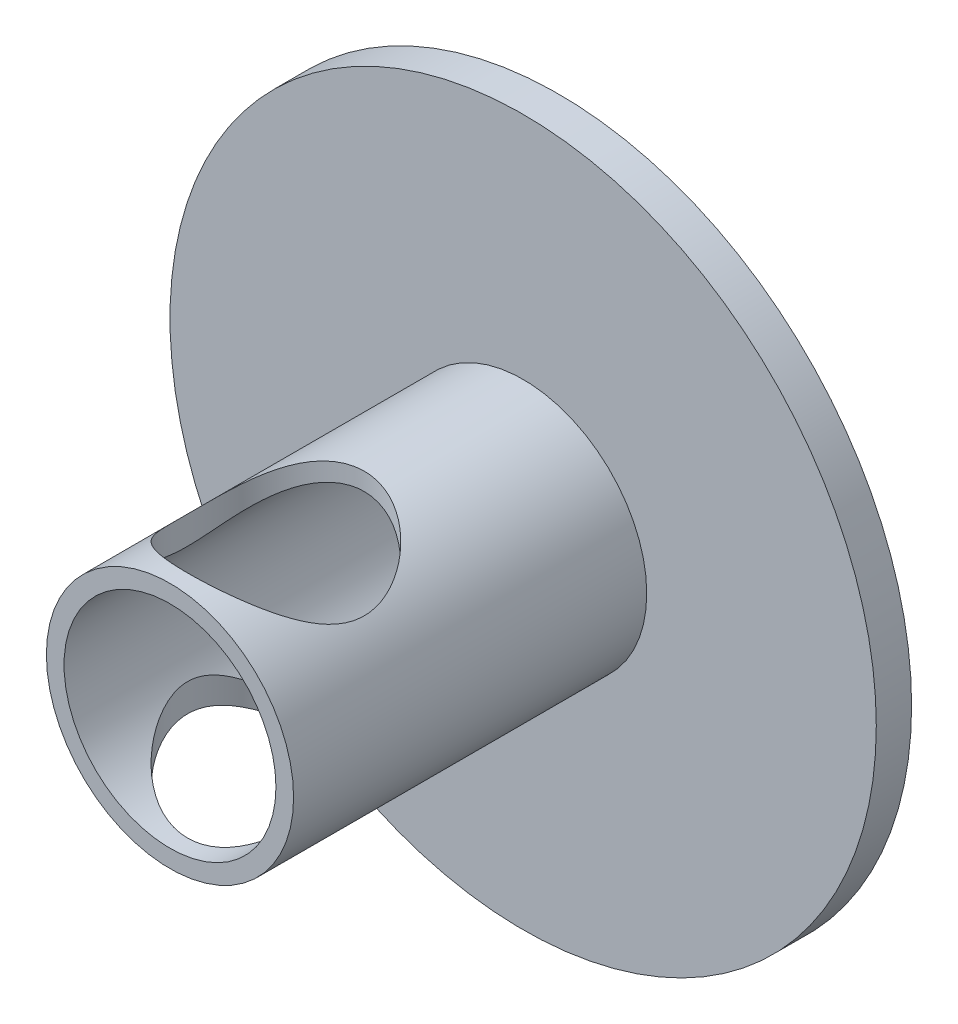
ISO-10303-21;
HEADER;
FILE_DESCRIPTION(('STEP AP214'),'2;1');
FILE_NAME('part.step','',(''),(''),'','','');
FILE_SCHEMA(('AUTOMOTIVE_DESIGN { 1 0 10303 214 1 1 1 1 }'));
ENDSEC;
DATA;
#1=APPLICATION_CONTEXT('core data for automotive mechanical design processes');
#2=APPLICATION_PROTOCOL_DEFINITION('international standard','automotive_design',2000,#1);
#3=PRODUCT_CONTEXT('',#1,'mechanical');
#4=PRODUCT('Part','Part','',(#3));
#5=PRODUCT_RELATED_PRODUCT_CATEGORY('part','',(#4));
#6=PRODUCT_DEFINITION_FORMATION('','',#4);
#7=PRODUCT_DEFINITION_CONTEXT('part definition',#1,'design');
#8=PRODUCT_DEFINITION('design','',#6,#7);
#9=PRODUCT_DEFINITION_SHAPE('','',#8);
#10=(LENGTH_UNIT() NAMED_UNIT(*) SI_UNIT(.MILLI.,.METRE.));
#11=(NAMED_UNIT(*) PLANE_ANGLE_UNIT() SI_UNIT($,.RADIAN.));
#12=(NAMED_UNIT(*) SI_UNIT($,.STERADIAN.) SOLID_ANGLE_UNIT());
#13=UNCERTAINTY_MEASURE_WITH_UNIT(LENGTH_MEASURE(1.E-05),#10,'distance_accuracy_value','');
#14=(GEOMETRIC_REPRESENTATION_CONTEXT(3) GLOBAL_UNCERTAINTY_ASSIGNED_CONTEXT((#13)) GLOBAL_UNIT_ASSIGNED_CONTEXT((#10,
#11,#12)) REPRESENTATION_CONTEXT('',''));
#15=CARTESIAN_POINT('',(0.,0.,0.));
#16=DIRECTION('',(0.,0.,1.));
#17=DIRECTION('',(1.,0.,0.));
#18=AXIS2_PLACEMENT_3D('',#15,#16,#17);
#19=CARTESIAN_POINT('',(0.,0.,11.));
#20=DIRECTION('',(0.,0.,-1.));
#21=DIRECTION('',(-1.,0.,0.));
#22=AXIS2_PLACEMENT_3D('',#19,#20,#21);
#23=CYLINDRICAL_SURFACE('',#22,3.5);
#24=CARTESIAN_POINT('',(0.,-3.5,10.5));
#25=CARTESIAN_POINT('',(0.123728813191222,-3.50000063992499,10.5000004827053));
#26=CARTESIAN_POINT('',(0.247452607509516,-3.4933837716556,10.4907620868086));
#27=CARTESIAN_POINT('',(0.490897056966874,-3.46756729775865,10.454421406987));
#28=CARTESIAN_POINT('',(0.610615946518802,-3.44836221741437,10.4273113505008));
#29=CARTESIAN_POINT('',(0.842134278979692,-3.39922983630841,10.356987654963));
#30=CARTESIAN_POINT('',(0.953970069083463,-3.36935620971461,10.3138545858561));
#31=CARTESIAN_POINT('',(1.168233996963,-3.30119473506674,10.2134238357578));
#32=CARTESIAN_POINT('',(1.27066087203769,-3.26290575998325,10.1561242573816));
#33=CARTESIAN_POINT('',(1.47359739797338,-3.17674762370412,10.0234877338017));
#34=CARTESIAN_POINT('',(1.57311214719789,-3.12832735809473,9.94699433698734));
#35=CARTESIAN_POINT('',(1.75878471370036,-3.02784542835157,9.7810699558849));
#36=CARTESIAN_POINT('',(1.84492211922786,-2.97577837204531,9.69161959547855));
#37=CARTESIAN_POINT('',(2.01766896264088,-2.86208795270918,9.48342689638932));
#38=CARTESIAN_POINT('',(2.10145177248815,-2.80046815480897,9.36232294225094));
#39=CARTESIAN_POINT('',(2.24759789691727,-2.68458125505737,9.10461183048464));
#40=CARTESIAN_POINT('',(2.30999535105655,-2.63030251861168,8.96802985025451));
#41=CARTESIAN_POINT('',(2.39420227525004,-2.5534193855033,8.72694080569946));
#42=CARTESIAN_POINT('',(2.42261104159707,-2.52624076170172,8.62621649979811));
#43=CARTESIAN_POINT('',(2.46675383593689,-2.48316150088386,8.41978123357636));
#44=CARTESIAN_POINT('',(2.48251474443328,-2.46723695421593,8.31408135706864));
#45=CARTESIAN_POINT('',(2.50034254973889,-2.44917774353956,8.0996013639044));
#46=CARTESIAN_POINT('',(2.50232049790355,-2.44713265311556,7.99080578120746));
#47=CARTESIAN_POINT('',(2.49216996728827,-2.45746365754188,7.77453482923222));
#48=CARTESIAN_POINT('',(2.48002983581053,-2.46985166511368,7.66706062461925));
#49=CARTESIAN_POINT('',(2.44019893993837,-2.50924006406184,7.44325427625938));
#50=CARTESIAN_POINT('',(2.41071787181288,-2.53790670458078,7.32754726582392));
#51=CARTESIAN_POINT('',(2.33698623060051,-2.60595426548793,7.10423527104888));
#52=CARTESIAN_POINT('',(2.29270292673412,-2.64535889377612,6.99664889512253));
#53=CARTESIAN_POINT('',(2.1751957137657,-2.74335980257756,6.7585440006148));
#54=CARTESIAN_POINT('',(2.09725595934496,-2.80411912140025,6.63125213429445));
#55=CARTESIAN_POINT('',(1.92080796250089,-2.92782316656879,6.39298538461337));
#56=CARTESIAN_POINT('',(1.82227950288255,-2.99076998991501,6.2820267236453));
#57=CARTESIAN_POINT('',(1.60466805722383,-3.11300197414732,6.07708982907151));
#58=CARTESIAN_POINT('',(1.4853922839611,-3.1722449907824,5.98328949935793));
#59=CARTESIAN_POINT('',(1.22853771239812,-3.28024169483458,5.81735525550954));
#60=CARTESIAN_POINT('',(1.09100185946149,-3.32901931213851,5.74517175992728));
#61=CARTESIAN_POINT('',(0.837977937487168,-3.4000592109999,5.64173480980913));
#62=CARTESIAN_POINT('',(0.725838222287996,-3.42591205063845,5.60473561949946));
#63=CARTESIAN_POINT('',(0.495579346511648,-3.46670277833946,5.5467451044777));
#64=CARTESIAN_POINT('',(0.37746459780423,-3.48164859772488,5.52574214720347));
#65=CARTESIAN_POINT('',(0.138134688429516,-3.49933682658195,5.50091315334622));
#66=CARTESIAN_POINT('',(0.0169109096294818,-3.50204052258512,5.4971416076009));
#67=CARTESIAN_POINT('',(-0.224436907512704,-3.49488258408794,5.50716695271995));
#68=CARTESIAN_POINT('',(-0.344560827664111,-3.48501961477187,5.52096570988017));
#69=CARTESIAN_POINT('',(-0.574421637419498,-3.45439685890596,5.56420957307143));
#70=CARTESIAN_POINT('',(-0.684380739703812,-3.43417853507595,5.59287803621718));
#71=CARTESIAN_POINT('',(-0.897567876620183,-3.38472449846573,5.66397547855573));
#72=CARTESIAN_POINT('',(-1.00079454106232,-3.35548695698345,5.70640724843385));
#73=CARTESIAN_POINT('',(-1.20788320476996,-3.28693977419552,5.80785488231404));
#74=CARTESIAN_POINT('',(-1.31095115376591,-3.24695646259529,5.86802707669856));
#75=CARTESIAN_POINT('',(-1.50595944144951,-3.16124256132458,6.00099062732356));
#76=CARTESIAN_POINT('',(-1.59789105848437,-3.11550752347251,6.07379176705508));
#77=CARTESIAN_POINT('',(-1.78551589650357,-3.01253197752163,6.2447675416652));
#78=CARTESIAN_POINT('',(-1.87887834330757,-2.95470727969555,6.34514974591498));
#79=CARTESIAN_POINT('',(-2.04830105316355,-2.83988174609795,6.56013508120656));
#80=CARTESIAN_POINT('',(-2.12435208766381,-2.7828813648528,6.67474574723456));
#81=CARTESIAN_POINT('',(-2.24734426464109,-2.68415113950396,6.89858289882527));
#82=CARTESIAN_POINT('',(-2.29697109549399,-2.64142413683916,7.00588614509743));
#83=CARTESIAN_POINT('',(-2.38125378942131,-2.56570672982987,7.22940079825844));
#84=CARTESIAN_POINT('',(-2.41594132264728,-2.53269577575563,7.34559273940918));
#85=CARTESIAN_POINT('',(-2.46347055711566,-2.4864056909299,7.56268214405476));
#86=CARTESIAN_POINT('',(-2.47917783706202,-2.47059656839569,7.66239739339382));
#87=CARTESIAN_POINT('',(-2.49835466240562,-2.45120901302811,7.86413637268432));
#88=CARTESIAN_POINT('',(-2.50183784984409,-2.44761694614496,7.96615740129017));
#89=CARTESIAN_POINT('',(-2.49632174120903,-2.45324019333321,8.16949179004957));
#90=CARTESIAN_POINT('',(-2.48732159992826,-2.46245637461123,8.27080510181903));
#91=CARTESIAN_POINT('',(-2.4574925600683,-2.492219484791,8.470014053357));
#92=CARTESIAN_POINT('',(-2.43664536213879,-2.51278394118379,8.56790415662941));
#93=CARTESIAN_POINT('',(-2.37535009925757,-2.57099790622707,8.7907070775183));
#94=CARTESIAN_POINT('',(-2.33065409759386,-2.61207539816562,8.913537986637));
#95=CARTESIAN_POINT('',(-2.22450059032402,-2.70305072969485,9.14815209267551));
#96=CARTESIAN_POINT('',(-2.16301522249262,-2.75296318217856,9.2599165006867));
#97=CARTESIAN_POINT('',(-2.02292450312523,-2.85755496874123,9.47466189095821));
#98=CARTESIAN_POINT('',(-1.94390312666539,-2.91232641309578,9.57732573723213));
#99=CARTESIAN_POINT('',(-1.77067968083209,-3.02079035562727,9.76959442662455));
#100=CARTESIAN_POINT('',(-1.67647239517755,-3.07448247590885,9.85919476228188));
#101=CARTESIAN_POINT('',(-1.45596509730874,-3.18556467553457,10.0380239526069));
#102=CARTESIAN_POINT('',(-1.32693197804395,-3.24201372320475,10.1245621516587));
#103=CARTESIAN_POINT('',(-1.12028117539171,-3.31667944446708,10.236316514043));
#104=CARTESIAN_POINT('',(-1.04921986546193,-3.33989867907091,10.2705572571761));
#105=CARTESIAN_POINT('',(-0.903173022827764,-3.38231539157863,10.3325028129925));
#106=CARTESIAN_POINT('',(-0.82818902614867,-3.40151442917428,10.3602101609261));
#107=CARTESIAN_POINT('',(-0.631868635659833,-3.44466177853938,10.4220729761585));
#108=CARTESIAN_POINT('',(-0.508104933005368,-3.46524216632153,10.4511405355378));
#109=CARTESIAN_POINT('',(-0.25622278065388,-3.49290436679927,10.490094448902));
#110=CARTESIAN_POINT('',(-0.128108700082399,-3.49999933742225,10.4999995002072));
#111=CARTESIAN_POINT('',(0.,-3.5,10.5));
#112=B_SPLINE_CURVE_WITH_KNOTS('',3,(#24,#25,#26,#27,#28,#29,#30,#31,#32,#33,#34,#35,#36,#37,
#38,#39,#40,#41,#42,#43,#44,#45,#46,#47,#48,#49,#50,#51,#52,#53,#54,#55,#56,#57,#58,#59,#60,#61,
#62,#63,#64,#65,#66,#67,#68,#69,#70,#71,#72,#73,#74,#75,#76,#77,#78,#79,#80,#81,#82,#83,#84,#85,
#86,#87,#88,#89,#90,#91,#92,#93,#94,#95,#96,#97,#98,#99,#100,#101,#102,#103,#104,#105,#106,#107,
#108,#109,#110,#111),.UNSPECIFIED.,.T.,.F.,(4,2,2,2,2,2,2,2,2,2,2,2,2,2,2,2,2,2,2,2,2,2,2,2,2,2,
2,2,2,2,2,2,2,2,2,2,2,2,2,2,2,2,2,4),(0.,0.370678561722367,0.741518441654494,1.1105182938468,
1.47956759466005,1.88169861959198,2.28443732992828,2.761244022053,3.23728595581205,
3.5604733900629,3.8829721210319,4.20755019318235,4.53239635392976,4.89878958243795,
5.26599840083137,5.74701313668837,6.22850244615384,6.7147314406568,7.19983650067082,
7.56096516289926,7.92183095866098,8.28383713289167,8.64588176217854,8.99068000299124,
9.33554819977708,9.7117432222691,10.0882309906956,10.532861167557,10.9777278203746,
11.3535772201855,11.7286258789008,12.0338187619669,12.3386709424265,12.6435437644841,
12.948888788046,13.357691273481,13.7671763401181,14.1876762226837,14.6083208537774,
15.100992340561,15.3472912000443,15.5934943266633,15.9776696091465,16.3614698531307),.UNSPECIFIED.);
#113=CARTESIAN_POINT('',(0.,-3.5,10.5));
#114=VERTEX_POINT('',#113);
#115=EDGE_CURVE('E77',#114,#114,#112,.T.);
#116=ORIENTED_EDGE('',*,*,#115,.T.);
#117=EDGE_LOOP('',(#116));
#118=FACE_BOUND('',#117,.T.);
#119=CARTESIAN_POINT('',(0.,0.,11.));
#120=DIRECTION('',(0.,0.,1.));
#121=DIRECTION('',(1.,0.,0.));
#122=AXIS2_PLACEMENT_3D('',#119,#120,#121);
#123=CIRCLE('',#122,3.5);
#124=CARTESIAN_POINT('',(3.5,0.,11.));
#125=VERTEX_POINT('',#124);
#126=EDGE_CURVE('E67',#125,#125,#123,.T.);
#127=ORIENTED_EDGE('',*,*,#126,.F.);
#128=EDGE_LOOP('',(#127));
#129=FACE_BOUND('',#128,.T.);
#130=CARTESIAN_POINT('',(0.,0.,1.));
#131=DIRECTION('',(0.,0.,1.));
#132=DIRECTION('',(1.,0.,0.));
#133=AXIS2_PLACEMENT_3D('',#130,#131,#132);
#134=CIRCLE('',#133,3.5);
#135=CARTESIAN_POINT('',(3.5,0.,1.));
#136=VERTEX_POINT('',#135);
#137=EDGE_CURVE('E12',#136,#136,#134,.T.);
#138=ORIENTED_EDGE('',*,*,#137,.T.);
#139=EDGE_LOOP('',(#138));
#140=FACE_BOUND('',#139,.T.);
#141=CARTESIAN_POINT('',(0.,3.5,5.50000000000005));
#142=CARTESIAN_POINT('',(-0.12372881319122,3.50000063992499,5.49999951729467));
#143=CARTESIAN_POINT('',(-0.247452607509514,3.4933837716556,5.50923791319137));
#144=CARTESIAN_POINT('',(-0.490897056966872,3.46756729775865,5.54557859301295));
#145=CARTESIAN_POINT('',(-0.6106159465188,3.44836221741437,5.57268864949916));
#146=CARTESIAN_POINT('',(-0.84213427897969,3.39922983630841,5.643012345037));
#147=CARTESIAN_POINT('',(-0.953970069083461,3.36935620971461,5.68614541414392));
#148=CARTESIAN_POINT('',(-1.168233996963,3.30119473506674,5.78657616424222));
#149=CARTESIAN_POINT('',(-1.27066087203769,3.26290575998325,5.84387574261838));
#150=CARTESIAN_POINT('',(-1.47359739797338,3.17674762370412,5.97651226619828));
#151=CARTESIAN_POINT('',(-1.57311214719789,3.12832735809473,6.05300566301266));
#152=CARTESIAN_POINT('',(-1.75878471370036,3.02784542835157,6.2189300441151));
#153=CARTESIAN_POINT('',(-1.84492211922786,2.97577837204531,6.30838040452145));
#154=CARTESIAN_POINT('',(-2.01766896264088,2.86208795270919,6.51657310361068));
#155=CARTESIAN_POINT('',(-2.10145177248815,2.80046815480897,6.63767705774906));
#156=CARTESIAN_POINT('',(-2.24759789691727,2.68458125505737,6.89538816951536));
#157=CARTESIAN_POINT('',(-2.30999535105655,2.63030251861169,7.03197014974549));
#158=CARTESIAN_POINT('',(-2.39420227525004,2.5534193855033,7.27305919430054));
#159=CARTESIAN_POINT('',(-2.42261104159707,2.52624076170172,7.37378350020189));
#160=CARTESIAN_POINT('',(-2.46675383593689,2.48316150088386,7.58021876642364));
#161=CARTESIAN_POINT('',(-2.48251474443328,2.46723695421593,7.68591864293136));
#162=CARTESIAN_POINT('',(-2.50034254973889,2.44917774353956,7.9003986360956));
#163=CARTESIAN_POINT('',(-2.50232049790355,2.44713265311556,8.00919421879254));
#164=CARTESIAN_POINT('',(-2.49216996728826,2.45746365754188,8.22546517076778));
#165=CARTESIAN_POINT('',(-2.48002983581053,2.46985166511368,8.33293937538075));
#166=CARTESIAN_POINT('',(-2.44019893993837,2.50924006406185,8.55674572374062));
#167=CARTESIAN_POINT('',(-2.41071787181288,2.53790670458078,8.67245273417608));
#168=CARTESIAN_POINT('',(-2.33698623060051,2.60595426548794,8.89576472895112));
#169=CARTESIAN_POINT('',(-2.29270292673412,2.64535889377612,9.00335110487747));
#170=CARTESIAN_POINT('',(-2.1751957137657,2.74335980257756,9.24145599938519));
#171=CARTESIAN_POINT('',(-2.09725595934496,2.80411912140026,9.36874786570555));
#172=CARTESIAN_POINT('',(-1.92080796250089,2.92782316656879,9.60701461538663));
#173=CARTESIAN_POINT('',(-1.82227950288254,2.99076998991501,9.71797327635471));
#174=CARTESIAN_POINT('',(-1.60466805722382,3.11300197414732,9.92291017092849));
#175=CARTESIAN_POINT('',(-1.4853922839611,3.1722449907824,10.0167105006421));
#176=CARTESIAN_POINT('',(-1.22853771239812,3.28024169483458,10.1826447444905));
#177=CARTESIAN_POINT('',(-1.09100185946148,3.32901931213851,10.2548282400727));
#178=CARTESIAN_POINT('',(-0.837977937487166,3.4000592109999,10.3582651901909));
#179=CARTESIAN_POINT('',(-0.725838222287994,3.42591205063845,10.3952643805005));
#180=CARTESIAN_POINT('',(-0.495579346511646,3.46670277833946,10.4532548955223));
#181=CARTESIAN_POINT('',(-0.377464597804229,3.48164859772488,10.4742578527965));
#182=CARTESIAN_POINT('',(-0.138134688429516,3.49933682658195,10.4990868466538));
#183=CARTESIAN_POINT('',(-0.0169109096294821,3.50204052258512,10.5028583923991));
#184=CARTESIAN_POINT('',(0.224436907512703,3.49488258408794,10.49283304728));
#185=CARTESIAN_POINT('',(0.344560827664111,3.48501961477187,10.4790342901198));
#186=CARTESIAN_POINT('',(0.574421637419499,3.45439685890596,10.4357904269286));
#187=CARTESIAN_POINT('',(0.684380739703813,3.43417853507595,10.4071219637828));
#188=CARTESIAN_POINT('',(0.897567876620184,3.38472449846573,10.3360245214443));
#189=CARTESIAN_POINT('',(1.00079454106232,3.35548695698345,10.2935927515662));
#190=CARTESIAN_POINT('',(1.20788320476996,3.28693977419552,10.192145117686));
#191=CARTESIAN_POINT('',(1.31095115376592,3.24695646259529,10.1319729233014));
#192=CARTESIAN_POINT('',(1.50595944144952,3.16124256132458,9.99900937267644));
#193=CARTESIAN_POINT('',(1.59789105848437,3.11550752347251,9.92620823294492));
#194=CARTESIAN_POINT('',(1.78551589650357,3.01253197752163,9.7552324583348));
#195=CARTESIAN_POINT('',(1.87887834330757,2.95470727969555,9.65485025408502));
#196=CARTESIAN_POINT('',(2.04830105316355,2.83988174609795,9.43986491879344));
#197=CARTESIAN_POINT('',(2.12435208766381,2.78288136485279,9.32525425276544));
#198=CARTESIAN_POINT('',(2.24734426464109,2.68415113950396,9.10141710117473));
#199=CARTESIAN_POINT('',(2.29697109549399,2.64142413683916,8.99411385490257));
#200=CARTESIAN_POINT('',(2.38125378942131,2.56570672982987,8.77059920174156));
#201=CARTESIAN_POINT('',(2.41594132264728,2.53269577575563,8.65440726059082));
#202=CARTESIAN_POINT('',(2.46347055711566,2.4864056909299,8.43731785594524));
#203=CARTESIAN_POINT('',(2.47917783706202,2.47059656839569,8.33760260660619));
#204=CARTESIAN_POINT('',(2.49835466240562,2.4512090130281,8.13586362731568));
#205=CARTESIAN_POINT('',(2.50183784984409,2.44761694614496,8.03384259870984));
#206=CARTESIAN_POINT('',(2.49632174120904,2.45324019333321,7.83050820995043));
#207=CARTESIAN_POINT('',(2.48732159992826,2.46245637461122,7.72919489818097));
#208=CARTESIAN_POINT('',(2.4574925600683,2.492219484791,7.529985946643));
#209=CARTESIAN_POINT('',(2.4366453621388,2.51278394118378,7.43209584337059));
#210=CARTESIAN_POINT('',(2.37535009925757,2.57099790622707,7.20929292248171));
#211=CARTESIAN_POINT('',(2.33065409759386,2.61207539816562,7.086462013363));
#212=CARTESIAN_POINT('',(2.22450059032402,2.70305072969485,6.8518479073245));
#213=CARTESIAN_POINT('',(2.16301522249262,2.75296318217856,6.74008349931331));
#214=CARTESIAN_POINT('',(2.02292450312523,2.85755496874123,6.52533810904179));
#215=CARTESIAN_POINT('',(1.9439031266654,2.91232641309578,6.42267426276787));
#216=CARTESIAN_POINT('',(1.77067968083209,3.02079035562727,6.23040557337546));
#217=CARTESIAN_POINT('',(1.67647239517756,3.07448247590885,6.14080523771812));
#218=CARTESIAN_POINT('',(1.45596509730874,3.18556467553456,5.96197604739312));
#219=CARTESIAN_POINT('',(1.32693197804396,3.24201372320475,5.87543784834132));
#220=CARTESIAN_POINT('',(1.12028117539171,3.31667944446708,5.76368348595704));
#221=CARTESIAN_POINT('',(1.04921986546194,3.33989867907091,5.72944274282389));
#222=CARTESIAN_POINT('',(0.90317302282777,3.38231539157863,5.66749718700746));
#223=CARTESIAN_POINT('',(0.828189026148676,3.40151442917428,5.63978983907394));
#224=CARTESIAN_POINT('',(0.631868635659839,3.44466177853938,5.57792702384148));
#225=CARTESIAN_POINT('',(0.508104933005374,3.46524216632153,5.54885946446219));
#226=CARTESIAN_POINT('',(0.256222780653885,3.49290436679927,5.50990555109796));
#227=CARTESIAN_POINT('',(0.128108700082402,3.49999933742225,5.50000049979275));
#228=CARTESIAN_POINT('',(0.,3.5,5.50000000000005));
#229=B_SPLINE_CURVE_WITH_KNOTS('',3,(#141,#142,#143,#144,#145,#146,#147,#148,#149,#150,#151,
#152,#153,#154,#155,#156,#157,#158,#159,#160,#161,#162,#163,#164,#165,#166,#167,#168,#169,#170,
#171,#172,#173,#174,#175,#176,#177,#178,#179,#180,#181,#182,#183,#184,#185,#186,#187,#188,#189,
#190,#191,#192,#193,#194,#195,#196,#197,#198,#199,#200,#201,#202,#203,#204,#205,#206,#207,#208,
#209,#210,#211,#212,#213,#214,#215,#216,#217,#218,#219,#220,#221,#222,#223,#224,#225,#226,#227,
#228),.UNSPECIFIED.,.T.,.F.,(4,2,2,2,2,2,2,2,2,2,2,2,2,2,2,2,2,2,2,2,2,2,2,2,2,2,2,2,2,2,2,2,2,
2,2,2,2,2,2,2,2,2,2,4),(0.,0.370678561722367,0.741518441654494,1.1105182938468,1.47956759466005,
1.88169861959198,2.28443732992828,2.761244022053,3.23728595581205,3.5604733900629,
3.8829721210319,4.20755019318235,4.53239635392976,4.89878958243795,5.26599840083137,
5.74701313668837,6.22850244615384,6.7147314406568,7.19983650067082,7.56096516289926,
7.92183095866098,8.28383713289166,8.64588176217854,8.99068000299124,9.33554819977708,
9.71174322226909,10.0882309906956,10.532861167557,10.9777278203746,11.3535772201855,
11.7286258789008,12.0338187619669,12.3386709424265,12.6435437644841,12.948888788046,
13.357691273481,13.7671763401181,14.1876762226837,14.6083208537774,15.100992340561,
15.3472912000443,15.5934943266633,15.9776696091465,16.3614698531307),.UNSPECIFIED.);
#230=CARTESIAN_POINT('',(0.,3.5,5.50000000000005));
#231=VERTEX_POINT('',#230);
#232=EDGE_CURVE('E78',#231,#231,#229,.T.);
#233=ORIENTED_EDGE('',*,*,#232,.F.);
#234=EDGE_LOOP('',(#233));
#235=FACE_BOUND('',#234,.T.);
#236=ADVANCED_FACE('F46',(#118,#129,#140,#235),#23,.T.);
#237=CARTESIAN_POINT('',(0.,0.,0.999999999999999));
#238=DIRECTION('',(0.,0.,1.));
#239=DIRECTION('',(1.,0.,0.));
#240=AXIS2_PLACEMENT_3D('',#237,#238,#239);
#241=CYLINDRICAL_SURFACE('',#240,3.);
#242=CARTESIAN_POINT('',(0.,-3.,10.5));
#243=CARTESIAN_POINT('',(-0.1187575331932,-2.99999522795205,10.4999951144463));
#244=CARTESIAN_POINT('',(-0.237551281104123,-2.99288670594742,10.4914774960954));
#245=CARTESIAN_POINT('',(-0.471182492492803,-2.96510762868268,10.4580372766481));
#246=CARTESIAN_POINT('',(-0.586016959612408,-2.94442702942008,10.4331025260246));
#247=CARTESIAN_POINT('',(-0.807829942407285,-2.89142690238865,10.3686878826672));
#248=CARTESIAN_POINT('',(-0.914850920904888,-2.8591769655007,10.3292949256462));
#249=CARTESIAN_POINT('',(-1.11984139043406,-2.78529176182903,10.2379829520574));
#250=CARTESIAN_POINT('',(-1.21780780775232,-2.74365332434937,10.1860597033267));
#251=CARTESIAN_POINT('',(-1.43789998519764,-2.63674191529868,10.0505462501918));
#252=CARTESIAN_POINT('',(-1.55568219657217,-2.56840549256193,9.96232979581778));
#253=CARTESIAN_POINT('',(-1.77202398328144,-2.42422624777676,9.76947567424859));
#254=CARTESIAN_POINT('',(-1.87052845158601,-2.34836281453279,9.66479243075685));
#255=CARTESIAN_POINT('',(-2.00437263805585,-2.23294886313741,9.49591572350887));
#256=CARTESIAN_POINT('',(-2.04699726278812,-2.19383679995,9.43704442380866));
#257=CARTESIAN_POINT('',(-2.12715295529551,-2.11620611809197,9.31549439703946));
#258=CARTESIAN_POINT('',(-2.16468231743736,-2.07768770195027,9.25281440512922));
#259=CARTESIAN_POINT('',(-2.23441122570743,-2.00250543288666,9.12373267566435));
#260=CARTESIAN_POINT('',(-2.26662332666223,-1.96583735754655,9.05734021527515));
#261=CARTESIAN_POINT('',(-2.32553690612788,-1.89577686630316,8.92055371607158));
#262=CARTESIAN_POINT('',(-2.35224307998676,-1.86238167220909,8.85016315265817));
#263=CARTESIAN_POINT('',(-2.40193513934001,-1.79791918980418,8.69833290979987));
#264=CARTESIAN_POINT('',(-2.42433807692594,-1.76736311251009,8.61647590727648));
#265=CARTESIAN_POINT('',(-2.46101313675498,-1.7159318055601,8.44811023118686));
#266=CARTESIAN_POINT('',(-2.47530499393788,-1.69503310194204,8.36161341338529));
#267=CARTESIAN_POINT('',(-2.49481072799043,-1.66620928968851,8.18423459162051));
#268=CARTESIAN_POINT('',(-2.49991205058662,-1.658445105631,8.09331204092927));
#269=CARTESIAN_POINT('',(-2.50008569371185,-1.65818308531833,7.9114373869972));
#270=CARTESIAN_POINT('',(-2.49515788278399,-1.66568544916948,7.82048528338463));
#271=CARTESIAN_POINT('',(-2.47505262029588,-1.69541639464506,7.63447528917284));
#272=CARTESIAN_POINT('',(-2.45905577113326,-1.71881932066475,7.53970625428289));
#273=CARTESIAN_POINT('',(-2.41742550503021,-1.77688235738923,7.35578901879778));
#274=CARTESIAN_POINT('',(-2.39176011044283,-1.81157977103034,7.26666062928513));
#275=CARTESIAN_POINT('',(-2.33816270346866,-1.88002226126146,7.11217292145885));
#276=CARTESIAN_POINT('',(-2.31177513033558,-1.91250316845448,7.0456877575883));
#277=CARTESIAN_POINT('',(-2.25404424958628,-1.98021996661539,6.91634919322002));
#278=CARTESIAN_POINT('',(-2.22269803586297,-2.01545746697795,6.85349795213411));
#279=CARTESIAN_POINT('',(-2.12149677560456,-2.12342648109734,6.67003315898027));
#280=CARTESIAN_POINT('',(-2.04450664231767,-2.19837696967447,6.55458585239386));
#281=CARTESIAN_POINT('',(-1.86765914501403,-2.35079897952287,6.3317330375456));
#282=CARTESIAN_POINT('',(-1.76681805277617,-2.42819792618953,6.22506167600807));
#283=CARTESIAN_POINT('',(-1.54484388336136,-2.57509054043293,6.02888765518256));
#284=CARTESIAN_POINT('',(-1.4237556561576,-2.64460112267371,5.93934796694371));
#285=CARTESIAN_POINT('',(-1.19411179169402,-2.75428914126553,5.80058516090143));
#286=CARTESIAN_POINT('',(-1.08972732107263,-2.79748350074001,5.74685710181234));
#287=CARTESIAN_POINT('',(-0.871071458330231,-2.87307804019805,5.65365725474467));
#288=CARTESIAN_POINT('',(-0.75680629278063,-2.90548495660808,5.61417656841944));
#289=CARTESIAN_POINT('',(-0.519954301215292,-2.95709834265567,5.55158275006782));
#290=CARTESIAN_POINT('',(-0.397310923125186,-2.97620280955846,5.52859605334247));
#291=CARTESIAN_POINT('',(-0.148559976923615,-2.99891434528973,5.50129076807286));
#292=CARTESIAN_POINT('',(-0.0224547835238961,-3.00253178304177,5.49695968914989));
#293=CARTESIAN_POINT('',(0.213310199456671,-2.99444999039146,5.50666243944382));
#294=CARTESIAN_POINT('',(0.323130540835952,-2.98453350716312,5.51855863871523));
#295=CARTESIAN_POINT('',(0.53864496440069,-2.95325589460134,5.55626695021156));
#296=CARTESIAN_POINT('',(0.644338549989642,-2.93189339242794,5.58208073171904));
#297=CARTESIAN_POINT('',(0.850565499199331,-2.87889521546184,5.64662339545534));
#298=CARTESIAN_POINT('',(0.951010682223389,-2.84712564891972,5.68552078944435));
#299=CARTESIAN_POINT('',(1.1436590089811,-2.77536124733887,5.77439563233679));
#300=CARTESIAN_POINT('',(1.23585908831217,-2.73536337221805,5.82437717699339));
#301=CARTESIAN_POINT('',(1.45067439735105,-2.62975152158591,5.95843179534707));
#302=CARTESIAN_POINT('',(1.56834359540737,-2.56070244234711,6.04773258326741));
#303=CARTESIAN_POINT('',(1.78428994740853,-2.41522445403187,6.24284038265575));
#304=CARTESIAN_POINT('',(1.88250490855177,-2.33877300422831,6.34869845535487));
#305=CARTESIAN_POINT('',(2.01573314784295,-2.22269805598597,6.51941196792875));
#306=CARTESIAN_POINT('',(2.05811069143953,-2.18341151736026,6.57889827297613));
#307=CARTESIAN_POINT('',(2.13771669597409,-2.10553153817178,6.70172081603242));
#308=CARTESIAN_POINT('',(2.17494330406758,-2.06693835133604,6.76505842766425));
#309=CARTESIAN_POINT('',(2.24398857026759,-1.99176108482637,6.89548840391535));
#310=CARTESIAN_POINT('',(2.2758214878154,-1.9551718863421,6.96257022453377));
#311=CARTESIAN_POINT('',(2.33388856739461,-1.88547561448177,7.1007901045));
#312=CARTESIAN_POINT('',(2.36012785984656,-1.85236536450789,7.17192437041954));
#313=CARTESIAN_POINT('',(2.40837357148322,-1.78925557416047,7.32427036835206));
#314=CARTESIAN_POINT('',(2.42988314318544,-1.75970711786654,7.4058344510739));
#315=CARTESIAN_POINT('',(2.46482255689512,-1.7104306388743,7.57345195394278));
#316=CARTESIAN_POINT('',(2.47827257713354,-1.69067811225263,7.65949357132805));
#317=CARTESIAN_POINT('',(2.49617289535259,-1.66415315979466,7.8356376074125));
#318=CARTESIAN_POINT('',(2.50051799183956,-1.65753251048398,7.92577532975085));
#319=CARTESIAN_POINT('',(2.4993819710445,-1.65924308630675,8.10585321278409));
#320=CARTESIAN_POINT('',(2.49389826274006,-1.66757825402164,8.19579331512528));
#321=CARTESIAN_POINT('',(2.47265263848533,-1.6989289873553,8.38167257539067));
#322=CARTESIAN_POINT('',(2.45585812550753,-1.72341371023869,8.47723027053284));
#323=CARTESIAN_POINT('',(2.41250339675081,-1.783587280374,8.66253129608288));
#324=CARTESIAN_POINT('',(2.38591088285898,-1.8193131253134,8.75225422870948));
#325=CARTESIAN_POINT('',(2.33050835844906,-1.88952619366209,8.90778904135503));
#326=CARTESIAN_POINT('',(2.30325853049518,-1.92277816627807,8.97474375923511));
#327=CARTESIAN_POINT('',(2.24370627017997,-1.99195185230588,9.1049463864246));
#328=CARTESIAN_POINT('',(2.21140090020848,-2.02787511150537,9.16819211100002));
#329=CARTESIAN_POINT('',(2.10716294428967,-2.13775931167931,9.35272956134216));
#330=CARTESIAN_POINT('',(2.0279357674373,-2.21379780164339,9.46874692499214));
#331=CARTESIAN_POINT('',(1.84629697567389,-2.36772603763566,9.69200726129145));
#332=CARTESIAN_POINT('',(1.74293959593253,-2.44552394429532,9.79854179403312));
#333=CARTESIAN_POINT('',(1.51553554935589,-2.59256498427773,9.99386379953952));
#334=CARTESIAN_POINT('',(1.39153583663181,-2.66182692543086,10.0826905658741));
#335=CARTESIAN_POINT('',(1.15855518141046,-2.76942305781524,10.2183141967232));
#336=CARTESIAN_POINT('',(1.05399877947656,-2.81112174006896,10.2700385102196));
#337=CARTESIAN_POINT('',(0.83543978605399,-2.88361460666463,10.3592186702387));
#338=CARTESIAN_POINT('',(0.72145002675354,-2.91442331323779,10.3966935240954));
#339=CARTESIAN_POINT('',(0.506620038886554,-2.95858745904695,10.4501884558266));
#340=CARTESIAN_POINT('',(0.406845468761678,-2.97402142398114,10.4687751222268));
#341=CARTESIAN_POINT('',(0.204722725654112,-2.99472922794409,10.493682368238));
#342=CARTESIAN_POINT('',(0.102374818922722,-3.00000411373941,10.5000042115869));
#343=CARTESIAN_POINT('',(0.,-3.,10.5));
#344=B_SPLINE_CURVE_WITH_KNOTS('',3,(#242,#243,#244,#245,#246,#247,#248,#249,#250,#251,#252,
#253,#254,#255,#256,#257,#258,#259,#260,#261,#262,#263,#264,#265,#266,#267,#268,#269,#270,#271,
#272,#273,#274,#275,#276,#277,#278,#279,#280,#281,#282,#283,#284,#285,#286,#287,#288,#289,#290,
#291,#292,#293,#294,#295,#296,#297,#298,#299,#300,#301,#302,#303,#304,#305,#306,#307,#308,#309,
#310,#311,#312,#313,#314,#315,#316,#317,#318,#319,#320,#321,#322,#323,#324,#325,#326,#327,#328,
#329,#330,#331,#332,#333,#334,#335,#336,#337,#338,#339,#340,#341,#342,#343),.UNSPECIFIED.,.T.,
.F.,(4,2,2,2,2,2,2,2,2,2,2,2,2,2,2,2,2,2,2,2,2,2,2,2,2,2,2,2,2,2,2,2,2,2,2,2,2,2,2,2,2,2,2,2,2,
2,2,2,2,2,4),(0.,0.355841276815108,0.711946191026951,1.06594405359549,1.42006164830114,
1.90425178760123,2.38980643116771,2.63722280423444,2.88472179650719,3.1316277794367,
3.37832232674667,3.64812890035748,3.91727616616863,4.18969776924969,4.46212294312041,
4.75723524199717,5.05333228584564,5.28870178855691,5.5242097486863,5.99549339358978,
6.49137310548269,6.98616858956864,7.36002155957571,7.73364063000469,8.11009395319713,
8.4862951927435,8.81743460677915,9.1486137466986,9.48423297747595,9.81997643164422,
10.3065635514455,10.7946819775666,11.0432812121087,11.2919696391638,11.5399899810635,
11.7877818528619,12.0551105531684,12.3217671309316,12.5914881373798,12.861280256845,
13.1598101383751,13.4593330283461,13.6977271411686,13.9362602949128,14.4135864576438,
14.914300110886,15.413889999571,15.7841228897598,16.1538601797496,16.4606444271241,
16.767397062512),.UNSPECIFIED.);
#345=CARTESIAN_POINT('',(0.,-3.,10.5));
#346=VERTEX_POINT('',#345);
#347=EDGE_CURVE('E71',#346,#346,#344,.T.);
#348=ORIENTED_EDGE('',*,*,#347,.T.);
#349=EDGE_LOOP('',(#348));
#350=FACE_BOUND('',#349,.T.);
#351=CARTESIAN_POINT('',(0.,0.,0.999999999999999));
#352=DIRECTION('',(0.,0.,1.));
#353=DIRECTION('',(1.,0.,0.));
#354=AXIS2_PLACEMENT_3D('',#351,#352,#353);
#355=CIRCLE('',#354,3.);
#356=CARTESIAN_POINT('',(3.,0.,0.999999999999999));
#357=VERTEX_POINT('',#356);
#358=EDGE_CURVE('E103',#357,#357,#355,.T.);
#359=ORIENTED_EDGE('',*,*,#358,.F.);
#360=EDGE_LOOP('',(#359));
#361=FACE_BOUND('',#360,.T.);
#362=CARTESIAN_POINT('',(0.,0.,11.));
#363=DIRECTION('',(0.,0.,1.));
#364=DIRECTION('',(1.,0.,0.));
#365=AXIS2_PLACEMENT_3D('',#362,#363,#364);
#366=CIRCLE('',#365,3.);
#367=CARTESIAN_POINT('',(3.,0.,11.));
#368=VERTEX_POINT('',#367);
#369=EDGE_CURVE('E99',#368,#368,#366,.T.);
#370=ORIENTED_EDGE('',*,*,#369,.T.);
#371=EDGE_LOOP('',(#370));
#372=FACE_BOUND('',#371,.T.);
#373=CARTESIAN_POINT('',(0.,3.,5.50000000000005));
#374=CARTESIAN_POINT('',(0.118757533193203,2.99999522795205,5.50000488555373));
#375=CARTESIAN_POINT('',(0.237551281104125,2.99288670594742,5.50852250390463));
#376=CARTESIAN_POINT('',(0.471182492492805,2.96510762868268,5.54196272335188));
#377=CARTESIAN_POINT('',(0.58601695961241,2.94442702942008,5.56689747397536));
#378=CARTESIAN_POINT('',(0.807829942407287,2.89142690238865,5.63131211733275));
#379=CARTESIAN_POINT('',(0.91485092090489,2.8591769655007,5.67070507435376));
#380=CARTESIAN_POINT('',(1.11984139043407,2.78529176182903,5.76201704794262));
#381=CARTESIAN_POINT('',(1.21780780775232,2.74365332434937,5.8139402966733));
#382=CARTESIAN_POINT('',(1.43789998519765,2.63674191529868,5.9494537498082));
#383=CARTESIAN_POINT('',(1.55568219657218,2.56840549256192,6.03767020418222));
#384=CARTESIAN_POINT('',(1.77202398328144,2.42422624777675,6.23052432575141));
#385=CARTESIAN_POINT('',(1.87052845158602,2.34836281453278,6.33520756924315));
#386=CARTESIAN_POINT('',(2.00437263805585,2.23294886313741,6.50408427649113));
#387=CARTESIAN_POINT('',(2.04699726278813,2.19383679995,6.56295557619134));
#388=CARTESIAN_POINT('',(2.12715295529551,2.11620611809197,6.68450560296054));
#389=CARTESIAN_POINT('',(2.16468231743736,2.07768770195026,6.74718559487078));
#390=CARTESIAN_POINT('',(2.23441122570743,2.00250543288665,6.87626732433565));
#391=CARTESIAN_POINT('',(2.26662332666223,1.96583735754655,6.94265978472486));
#392=CARTESIAN_POINT('',(2.32553690612788,1.89577686630316,7.07944628392843));
#393=CARTESIAN_POINT('',(2.35224307998676,1.86238167220909,7.14983684734183));
#394=CARTESIAN_POINT('',(2.40193513934002,1.79791918980417,7.30166709020014));
#395=CARTESIAN_POINT('',(2.42433807692594,1.76736311251008,7.38352409272352));
#396=CARTESIAN_POINT('',(2.46101313675498,1.7159318055601,7.55188976881314));
#397=CARTESIAN_POINT('',(2.47530499393788,1.69503310194203,7.63838658661471));
#398=CARTESIAN_POINT('',(2.49481072799043,1.66620928968851,7.8157654083795));
#399=CARTESIAN_POINT('',(2.49991205058663,1.658445105631,7.90668795907073));
#400=CARTESIAN_POINT('',(2.50008569371185,1.65818308531833,8.0885626130028));
#401=CARTESIAN_POINT('',(2.49515788278399,1.66568544916947,8.17951471661538));
#402=CARTESIAN_POINT('',(2.47505262029589,1.69541639464506,8.36552471082716));
#403=CARTESIAN_POINT('',(2.45905577113326,1.71881932066475,8.46029374571711));
#404=CARTESIAN_POINT('',(2.41742550503021,1.77688235738922,8.64421098120222));
#405=CARTESIAN_POINT('',(2.39176011044283,1.81157977103034,8.73333937071487));
#406=CARTESIAN_POINT('',(2.33816270346866,1.88002226126146,8.88782707854116));
#407=CARTESIAN_POINT('',(2.31177513033558,1.91250316845448,8.95431224241171));
#408=CARTESIAN_POINT('',(2.25404424958628,1.98021996661539,9.08365080677999));
#409=CARTESIAN_POINT('',(2.22269803586297,2.01545746697795,9.14650204786589));
#410=CARTESIAN_POINT('',(2.12149677560456,2.12342648109734,9.32996684101973));
#411=CARTESIAN_POINT('',(2.04450664231767,2.19837696967447,9.44541414760614));
#412=CARTESIAN_POINT('',(1.86765914501403,2.35079897952286,9.6682669624544));
#413=CARTESIAN_POINT('',(1.76681805277617,2.42819792618953,9.77493832399193));
#414=CARTESIAN_POINT('',(1.54484388336136,2.57509054043293,9.97111234481744));
#415=CARTESIAN_POINT('',(1.4237556561576,2.64460112267371,10.0606520330563));
#416=CARTESIAN_POINT('',(1.19411179169402,2.75428914126553,10.1994148390986));
#417=CARTESIAN_POINT('',(1.08972732107263,2.79748350074001,10.2531428981877));
#418=CARTESIAN_POINT('',(0.871071458330231,2.87307804019805,10.3463427452553));
#419=CARTESIAN_POINT('',(0.75680629278063,2.90548495660808,10.3858234315806));
#420=CARTESIAN_POINT('',(0.519954301215292,2.95709834265567,10.4484172499322));
#421=CARTESIAN_POINT('',(0.397310923125186,2.97620280955846,10.4714039466575));
#422=CARTESIAN_POINT('',(0.148559976923615,2.99891434528973,10.4987092319271));
#423=CARTESIAN_POINT('',(0.0224547835238953,3.00253178304177,10.5030403108501));
#424=CARTESIAN_POINT('',(-0.213310199456672,2.99444999039146,10.4933375605562));
#425=CARTESIAN_POINT('',(-0.323130540835953,2.98453350716312,10.4814413612848));
#426=CARTESIAN_POINT('',(-0.538644964400691,2.95325589460134,10.4437330497884));
#427=CARTESIAN_POINT('',(-0.644338549989643,2.93189339242794,10.417919268281));
#428=CARTESIAN_POINT('',(-0.850565499199332,2.87889521546184,10.3533766045447));
#429=CARTESIAN_POINT('',(-0.951010682223389,2.84712564891972,10.3144792105556));
#430=CARTESIAN_POINT('',(-1.1436590089811,2.77536124733887,10.2256043676632));
#431=CARTESIAN_POINT('',(-1.23585908831217,2.73536337221805,10.1756228230066));
#432=CARTESIAN_POINT('',(-1.45067439735106,2.62975152158591,10.0415682046529));
#433=CARTESIAN_POINT('',(-1.56834359540737,2.56070244234711,9.95226741673259));
#434=CARTESIAN_POINT('',(-1.78428994740853,2.41522445403187,9.75715961734425));
#435=CARTESIAN_POINT('',(-1.88250490855177,2.33877300422831,9.65130154464513));
#436=CARTESIAN_POINT('',(-2.01573314784295,2.22269805598597,9.48058803207125));
#437=CARTESIAN_POINT('',(-2.05811069143953,2.18341151736026,9.42110172702387));
#438=CARTESIAN_POINT('',(-2.13771669597409,2.10553153817178,9.29827918396757));
#439=CARTESIAN_POINT('',(-2.17494330406758,2.06693835133604,9.23494157233575));
#440=CARTESIAN_POINT('',(-2.2439885702676,1.99176108482637,9.10451159608465));
#441=CARTESIAN_POINT('',(-2.2758214878154,1.95517188634209,9.03742977546623));
#442=CARTESIAN_POINT('',(-2.33388856739461,1.88547561448177,8.8992098955));
#443=CARTESIAN_POINT('',(-2.36012785984656,1.85236536450789,8.82807562958045));
#444=CARTESIAN_POINT('',(-2.40837357148322,1.78925557416047,8.67572963164793));
#445=CARTESIAN_POINT('',(-2.42988314318544,1.75970711786654,8.59416554892609));
#446=CARTESIAN_POINT('',(-2.46482255689512,1.7104306388743,8.42654804605722));
#447=CARTESIAN_POINT('',(-2.47827257713354,1.69067811225263,8.34050642867194));
#448=CARTESIAN_POINT('',(-2.49617289535259,1.66415315979466,8.1643623925875));
#449=CARTESIAN_POINT('',(-2.50051799183956,1.65753251048398,8.07422467024914));
#450=CARTESIAN_POINT('',(-2.4993819710445,1.65924308630675,7.8941467872159));
#451=CARTESIAN_POINT('',(-2.49389826274006,1.66757825402164,7.80420668487471));
#452=CARTESIAN_POINT('',(-2.47265263848533,1.6989289873553,7.61832742460932));
#453=CARTESIAN_POINT('',(-2.45585812550753,1.7234137102387,7.52276972946716));
#454=CARTESIAN_POINT('',(-2.41250339675081,1.78358728037401,7.33746870391711));
#455=CARTESIAN_POINT('',(-2.38591088285898,1.81931312531341,7.24774577129052));
#456=CARTESIAN_POINT('',(-2.33050835844906,1.8895261936621,7.09221095864496));
#457=CARTESIAN_POINT('',(-2.30325853049517,1.92277816627808,7.02525624076488));
#458=CARTESIAN_POINT('',(-2.24370627017997,1.99195185230588,6.8950536135754));
#459=CARTESIAN_POINT('',(-2.21140090020847,2.02787511150538,6.83180788899998));
#460=CARTESIAN_POINT('',(-2.10716294428966,2.13775931167932,6.64727043865783));
#461=CARTESIAN_POINT('',(-2.0279357674373,2.2137978016434,6.53125307500785));
#462=CARTESIAN_POINT('',(-1.84629697567388,2.36772603763567,6.30799273870854));
#463=CARTESIAN_POINT('',(-1.74293959593252,2.44552394429533,6.20145820596687));
#464=CARTESIAN_POINT('',(-1.51553554935588,2.59256498427774,6.00613620046047));
#465=CARTESIAN_POINT('',(-1.39153583663179,2.66182692543087,5.91730943412587));
#466=CARTESIAN_POINT('',(-1.15855518141045,2.76942305781524,5.78168580327676));
#467=CARTESIAN_POINT('',(-1.05399877947655,2.81112174006897,5.72996148978043));
#468=CARTESIAN_POINT('',(-0.835439786053976,2.88361460666464,5.64078132976134));
#469=CARTESIAN_POINT('',(-0.721450026753526,2.91442331323779,5.60330647590465));
#470=CARTESIAN_POINT('',(-0.506620038886542,2.95858745904696,5.5498115441734));
#471=CARTESIAN_POINT('',(-0.406845468761667,2.97402142398114,5.53122487777323));
#472=CARTESIAN_POINT('',(-0.204722725654105,2.99472922794409,5.50631763176196));
#473=CARTESIAN_POINT('',(-0.102374818922718,3.00000411373941,5.49999578841313));
#474=CARTESIAN_POINT('',(0.,3.,5.50000000000005));
#475=B_SPLINE_CURVE_WITH_KNOTS('',3,(#373,#374,#375,#376,#377,#378,#379,#380,#381,#382,#383,
#384,#385,#386,#387,#388,#389,#390,#391,#392,#393,#394,#395,#396,#397,#398,#399,#400,#401,#402,
#403,#404,#405,#406,#407,#408,#409,#410,#411,#412,#413,#414,#415,#416,#417,#418,#419,#420,#421,
#422,#423,#424,#425,#426,#427,#428,#429,#430,#431,#432,#433,#434,#435,#436,#437,#438,#439,#440,
#441,#442,#443,#444,#445,#446,#447,#448,#449,#450,#451,#452,#453,#454,#455,#456,#457,#458,#459,
#460,#461,#462,#463,#464,#465,#466,#467,#468,#469,#470,#471,#472,#473,#474),.UNSPECIFIED.,.T.,
.F.,(4,2,2,2,2,2,2,2,2,2,2,2,2,2,2,2,2,2,2,2,2,2,2,2,2,2,2,2,2,2,2,2,2,2,2,2,2,2,2,2,2,2,2,2,2,
2,2,2,2,2,4),(0.,0.355841276815108,0.711946191026951,1.06594405359549,1.42006164830114,
1.90425178760124,2.38980643116771,2.63722280423445,2.8847217965072,3.13162777943671,
3.37832232674668,3.64812890035749,3.91727616616864,4.18969776924969,4.46212294312041,
4.75723524199717,5.05333228584565,5.28870178855691,5.5242097486863,5.99549339358978,
6.49137310548269,6.98616858956864,7.36002155957571,7.73364063000469,8.11009395319713,
8.48629519274351,8.81743460677916,9.1486137466986,9.48423297747595,9.81997643164422,
10.3065635514455,10.7946819775666,11.0432812121087,11.2919696391638,11.5399899810635,
11.7877818528619,12.0551105531684,12.3217671309316,12.5914881373798,12.861280256845,
13.1598101383751,13.4593330283461,13.6977271411686,13.9362602949129,14.4135864576438,
14.9143001108861,15.4138899995711,15.7841228897599,16.1538601797496,16.4606444271241,
16.767397062512),.UNSPECIFIED.);
#476=CARTESIAN_POINT('',(0.,3.,5.50000000000005));
#477=VERTEX_POINT('',#476);
#478=EDGE_CURVE('E50',#477,#477,#475,.T.);
#479=ORIENTED_EDGE('',*,*,#478,.F.);
#480=EDGE_LOOP('',(#479));
#481=FACE_BOUND('',#480,.T.);
#482=ADVANCED_FACE('F79',(#350,#361,#372,#481),#241,.F.);
#483=CARTESIAN_POINT('',(0.,0.,1.));
#484=DIRECTION('',(0.,0.,-1.));
#485=DIRECTION('',(-1.,0.,0.));
#486=AXIS2_PLACEMENT_3D('',#483,#484,#485);
#487=CYLINDRICAL_SURFACE('',#486,10.);
#488=CARTESIAN_POINT('',(0.,0.,1.));
#489=DIRECTION('',(0.,0.,1.));
#490=DIRECTION('',(1.,0.,0.));
#491=AXIS2_PLACEMENT_3D('',#488,#489,#490);
#492=CIRCLE('',#491,10.);
#493=CARTESIAN_POINT('',(10.,0.,1.));
#494=VERTEX_POINT('',#493);
#495=EDGE_CURVE('E59',#494,#494,#492,.T.);
#496=ORIENTED_EDGE('',*,*,#495,.F.);
#497=EDGE_LOOP('',(#496));
#498=FACE_BOUND('',#497,.T.);
#499=CARTESIAN_POINT('',(0.,0.,0.));
#500=DIRECTION('',(0.,0.,1.));
#501=DIRECTION('',(1.,0.,0.));
#502=AXIS2_PLACEMENT_3D('',#499,#500,#501);
#503=CIRCLE('',#502,10.);
#504=CARTESIAN_POINT('',(10.,0.,0.));
#505=VERTEX_POINT('',#504);
#506=EDGE_CURVE('E64',#505,#505,#503,.T.);
#507=ORIENTED_EDGE('',*,*,#506,.T.);
#508=EDGE_LOOP('',(#507));
#509=FACE_BOUND('',#508,.T.);
#510=ADVANCED_FACE('F48',(#498,#509),#487,.T.);
#511=CARTESIAN_POINT('',(0.,0.,1.));
#512=DIRECTION('',(0.,0.,1.));
#513=DIRECTION('',(1.,0.,0.));
#514=AXIS2_PLACEMENT_3D('',#511,#512,#513);
#515=PLANE('',#514);
#516=ORIENTED_EDGE('',*,*,#137,.F.);
#517=EDGE_LOOP('',(#516));
#518=FACE_BOUND('',#517,.T.);
#519=ORIENTED_EDGE('',*,*,#495,.T.);
#520=EDGE_LOOP('',(#519));
#521=FACE_BOUND('',#520,.T.);
#522=ADVANCED_FACE('F109',(#518,#521),#515,.T.);
#523=CARTESIAN_POINT('',(0.,0.,0.));
#524=DIRECTION('',(0.,0.,1.));
#525=DIRECTION('',(1.,0.,0.));
#526=AXIS2_PLACEMENT_3D('',#523,#524,#525);
#527=PLANE('',#526);
#528=ORIENTED_EDGE('',*,*,#506,.F.);
#529=EDGE_LOOP('',(#528));
#530=FACE_BOUND('',#529,.T.);
#531=ADVANCED_FACE('F112',(#530),#527,.F.);
#532=CARTESIAN_POINT('',(0.,0.,11.));
#533=DIRECTION('',(0.,0.,1.));
#534=DIRECTION('',(1.,0.,0.));
#535=AXIS2_PLACEMENT_3D('',#532,#533,#534);
#536=PLANE('',#535);
#537=ORIENTED_EDGE('',*,*,#369,.F.);
#538=EDGE_LOOP('',(#537));
#539=FACE_BOUND('',#538,.T.);
#540=ORIENTED_EDGE('',*,*,#126,.T.);
#541=EDGE_LOOP('',(#540));
#542=FACE_BOUND('',#541,.T.);
#543=ADVANCED_FACE('F108',(#539,#542),#536,.T.);
#544=CARTESIAN_POINT('',(0.,0.,0.999999999999999));
#545=DIRECTION('',(0.,0.,1.));
#546=DIRECTION('',(1.,0.,0.));
#547=AXIS2_PLACEMENT_3D('',#544,#545,#546);
#548=PLANE('',#547);
#549=ORIENTED_EDGE('',*,*,#358,.T.);
#550=EDGE_LOOP('',(#549));
#551=FACE_BOUND('',#550,.T.);
#552=ADVANCED_FACE('F87',(#551),#548,.T.);
#553=CARTESIAN_POINT('',(0.,-10.,8.));
#554=DIRECTION('',(0.,1.,0.));
#555=DIRECTION('',(0.,0.,1.));
#556=AXIS2_PLACEMENT_3D('',#553,#554,#555);
#557=CYLINDRICAL_SURFACE('',#556,2.49999999999995);
#558=ORIENTED_EDGE('',*,*,#347,.F.);
#559=EDGE_LOOP('',(#558));
#560=FACE_BOUND('',#559,.T.);
#561=ORIENTED_EDGE('',*,*,#115,.F.);
#562=EDGE_LOOP('',(#561));
#563=FACE_BOUND('',#562,.T.);
#564=ADVANCED_FACE('F83',(#560,#563),#557,.F.);
#565=CARTESIAN_POINT('',(0.,10.,8.));
#566=DIRECTION('',(0.,-1.,0.));
#567=DIRECTION('',(0.,0.,-1.));
#568=AXIS2_PLACEMENT_3D('',#565,#566,#567);
#569=CYLINDRICAL_SURFACE('',#568,2.49999999999995);
#570=ORIENTED_EDGE('',*,*,#478,.T.);
#571=EDGE_LOOP('',(#570));
#572=FACE_BOUND('',#571,.T.);
#573=ORIENTED_EDGE('',*,*,#232,.T.);
#574=EDGE_LOOP('',(#573));
#575=FACE_BOUND('',#574,.T.);
#576=ADVANCED_FACE('F86',(#572,#575),#569,.F.);
#577=CLOSED_SHELL('',(#236,#482,#510,#522,#531,#543,#552,#564,#576));
#578=MANIFOLD_SOLID_BREP('B2',#577);
#579=ADVANCED_BREP_SHAPE_REPRESENTATION('',(#18,#578),#14);
#580=SHAPE_DEFINITION_REPRESENTATION(#9,#579);
ENDSEC;
END-ISO-10303-21;
